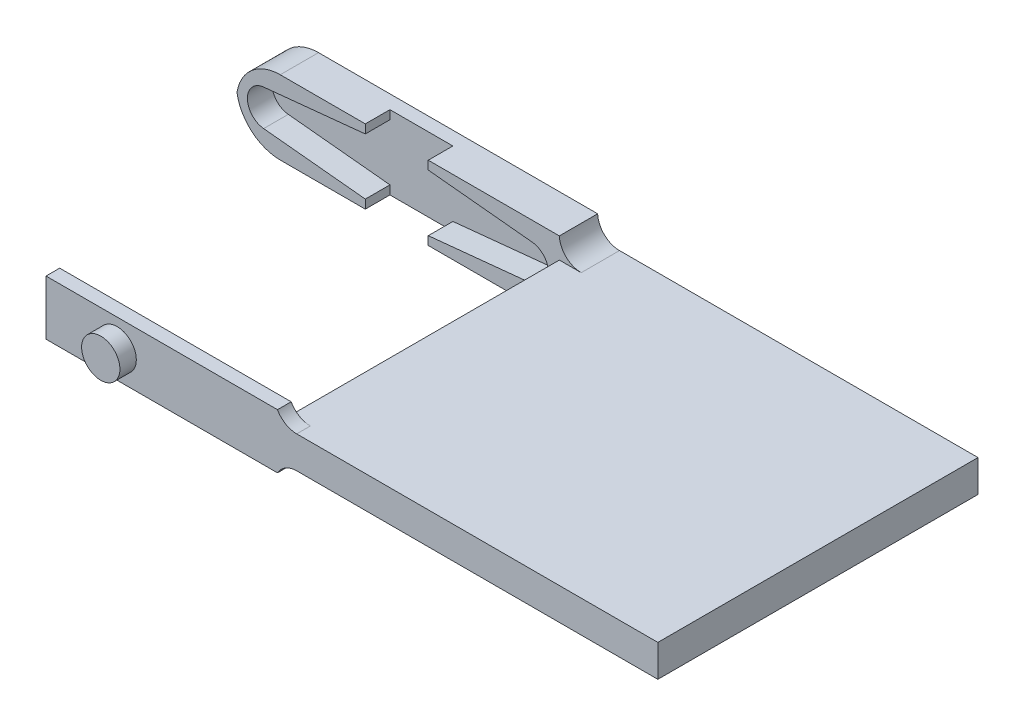
ISO-10303-21;
HEADER;
FILE_DESCRIPTION(('STEP AP214'),'2;1');
FILE_NAME('part.step','',(''),(''),'','','');
FILE_SCHEMA(('AUTOMOTIVE_DESIGN { 1 0 10303 214 1 1 1 1 }'));
ENDSEC;
DATA;
#1=APPLICATION_CONTEXT('core data for automotive mechanical design processes');
#2=APPLICATION_PROTOCOL_DEFINITION('international standard','automotive_design',2000,#1);
#3=PRODUCT_CONTEXT('',#1,'mechanical');
#4=PRODUCT('Part','Part','',(#3));
#5=PRODUCT_RELATED_PRODUCT_CATEGORY('part','',(#4));
#6=PRODUCT_DEFINITION_FORMATION('','',#4);
#7=PRODUCT_DEFINITION_CONTEXT('part definition',#1,'design');
#8=PRODUCT_DEFINITION('design','',#6,#7);
#9=PRODUCT_DEFINITION_SHAPE('','',#8);
#10=(LENGTH_UNIT() NAMED_UNIT(*) SI_UNIT(.MILLI.,.METRE.));
#11=(NAMED_UNIT(*) PLANE_ANGLE_UNIT() SI_UNIT($,.RADIAN.));
#12=(NAMED_UNIT(*) SI_UNIT($,.STERADIAN.) SOLID_ANGLE_UNIT());
#13=UNCERTAINTY_MEASURE_WITH_UNIT(LENGTH_MEASURE(1.E-05),#10,'distance_accuracy_value','');
#14=(GEOMETRIC_REPRESENTATION_CONTEXT(3) GLOBAL_UNCERTAINTY_ASSIGNED_CONTEXT((#13)) GLOBAL_UNIT_ASSIGNED_CONTEXT((#10,
#11,#12)) REPRESENTATION_CONTEXT('',''));
#15=CARTESIAN_POINT('',(0.,0.,0.));
#16=DIRECTION('',(0.,0.,1.));
#17=DIRECTION('',(1.,0.,0.));
#18=AXIS2_PLACEMENT_3D('',#15,#16,#17);
#19=CARTESIAN_POINT('',(0.,0.,29.2499999999999));
#20=DIRECTION('',(0.,0.,1.));
#21=DIRECTION('',(1.,0.,0.));
#22=AXIS2_PLACEMENT_3D('',#19,#20,#21);
#23=PLANE('',#22);
#24=DIRECTION('',(1.,0.,0.));
#25=VECTOR('',#24,1.);
#26=CARTESIAN_POINT('',(0.,4.83707186120483,29.2499999999999));
#27=LINE('',#26,#25);
#28=CARTESIAN_POINT('',(16.5034017605437,4.83707186120483,29.2499999999999));
#29=VERTEX_POINT('',#28);
#30=CARTESIAN_POINT('',(49.5,4.83707186120483,29.2499999999999));
#31=VERTEX_POINT('',#30);
#32=EDGE_CURVE('E509',#29,#31,#27,.T.);
#33=ORIENTED_EDGE('',*,*,#32,.F.);
#34=CARTESIAN_POINT('',(16.5034017605437,6.83707186120483,29.2499999999999));
#35=DIRECTION('',(0.,0.,1.));
#36=DIRECTION('',(1.,0.,0.));
#37=AXIS2_PLACEMENT_3D('',#34,#35,#36);
#38=CIRCLE('',#37,2.);
#39=CARTESIAN_POINT('',(14.75,5.87500000000001,29.2499999999999));
#40=VERTEX_POINT('',#39);
#41=EDGE_CURVE('E445',#29,#40,#38,.F.);
#42=ORIENTED_EDGE('',*,*,#41,.T.);
#43=DIRECTION('',(1.,0.,0.));
#44=VECTOR('',#43,1.);
#45=CARTESIAN_POINT('',(0.,5.87500000000001,29.2499999999999));
#46=LINE('',#45,#44);
#47=CARTESIAN_POINT('',(-6.4,5.875,29.2499999999999));
#48=VERTEX_POINT('',#47);
#49=EDGE_CURVE('E470',#48,#40,#46,.T.);
#50=ORIENTED_EDGE('',*,*,#49,.F.);
#51=DIRECTION('',(0.,-1.,0.));
#52=VECTOR('',#51,1.);
#53=CARTESIAN_POINT('',(-6.4,0.,29.2499999999999));
#54=LINE('',#53,#52);
#55=CARTESIAN_POINT('',(-6.4,0.875000000000003,29.2499999999999));
#56=VERTEX_POINT('',#55);
#57=EDGE_CURVE('E473',#48,#56,#54,.T.);
#58=ORIENTED_EDGE('',*,*,#57,.T.);
#59=DIRECTION('',(1.,0.,0.));
#60=VECTOR('',#59,1.);
#61=CARTESIAN_POINT('',(0.,0.875000000000003,29.2499999999999));
#62=LINE('',#61,#60);
#63=CARTESIAN_POINT('',(14.75,0.875000000000003,29.2499999999999));
#64=VERTEX_POINT('',#63);
#65=EDGE_CURVE('E488',#56,#64,#62,.T.);
#66=ORIENTED_EDGE('',*,*,#65,.T.);
#67=CARTESIAN_POINT('',(16.5034017605437,-0.0870718612048299,29.2499999999999));
#68=DIRECTION('',(0.,0.,1.));
#69=DIRECTION('',(1.,0.,0.));
#70=AXIS2_PLACEMENT_3D('',#67,#68,#69);
#71=CIRCLE('',#70,2.);
#72=CARTESIAN_POINT('',(16.5034017605437,1.91292813879517,29.2499999999999));
#73=VERTEX_POINT('',#72);
#74=EDGE_CURVE('E449',#64,#73,#71,.F.);
#75=ORIENTED_EDGE('',*,*,#74,.T.);
#76=DIRECTION('',(1.,0.,0.));
#77=VECTOR('',#76,1.);
#78=CARTESIAN_POINT('',(0.,1.91292813879517,29.2499999999999));
#79=LINE('',#78,#77);
#80=CARTESIAN_POINT('',(49.5,1.91292813879517,29.2499999999999));
#81=VERTEX_POINT('',#80);
#82=EDGE_CURVE('E511',#73,#81,#79,.T.);
#83=ORIENTED_EDGE('',*,*,#82,.T.);
#84=DIRECTION('',(0.,-1.,0.));
#85=VECTOR('',#84,1.);
#86=CARTESIAN_POINT('',(49.5,0.,29.2499999999999));
#87=LINE('',#86,#85);
#88=EDGE_CURVE('E513',#31,#81,#87,.T.);
#89=ORIENTED_EDGE('',*,*,#88,.F.);
#90=EDGE_LOOP('',(#33,#42,#50,#58,#66,#75,#83,#89));
#91=FACE_BOUND('',#90,.T.);
#92=CARTESIAN_POINT('',(0.102107464172101,3.37499999999936,29.2499999999999));
#93=DIRECTION('',(0.,0.,1.));
#94=DIRECTION('',(1.,0.,0.));
#95=AXIS2_PLACEMENT_3D('',#92,#93,#94);
#96=CIRCLE('',#95,1.75000000000144);
#97=CARTESIAN_POINT('',(1.85210746417354,3.37499999999936,29.2499999999999));
#98=VERTEX_POINT('',#97);
#99=EDGE_CURVE('E592',#98,#98,#96,.T.);
#100=ORIENTED_EDGE('',*,*,#99,.F.);
#101=EDGE_LOOP('',(#100));
#102=FACE_BOUND('',#101,.T.);
#103=ADVANCED_FACE('F139',(#91,#102),#23,.T.);
#104=CARTESIAN_POINT('',(0.,0.,3.5));
#105=DIRECTION('',(0.,0.,1.));
#106=DIRECTION('',(1.,0.,0.));
#107=AXIS2_PLACEMENT_3D('',#104,#105,#106);
#108=PLANE('',#107);
#109=DIRECTION('',(0.,-1.,0.));
#110=VECTOR('',#109,1.);
#111=CARTESIAN_POINT('',(-2.97710746417078,0.,3.5));
#112=LINE('',#111,#110);
#113=CARTESIAN_POINT('',(-2.97710746417078,0.799354218209792,3.5));
#114=VERTEX_POINT('',#113);
#115=CARTESIAN_POINT('',(-2.97710746417078,0.,3.5));
#116=VERTEX_POINT('',#115);
#117=EDGE_CURVE('E330',#114,#116,#112,.T.);
#118=ORIENTED_EDGE('',*,*,#117,.F.);
#119=DIRECTION('',(0.994982658758142,-0.10004753255617,0.));
#120=VECTOR('',#119,1.);
#121=CARTESIAN_POINT('',(0.0497727799724651,0.494995245614711,3.5));
#122=LINE('',#121,#120);
#123=CARTESIAN_POINT('',(-12.2650784287177,1.73327861304907,3.5));
#124=VERTEX_POINT('',#123);
#125=EDGE_CURVE('E370',#124,#114,#122,.T.);
#126=ORIENTED_EDGE('',*,*,#125,.F.);
#127=CARTESIAN_POINT('',(-12.1,3.375,3.5));
#128=DIRECTION('',(0.,0.,1.));
#129=DIRECTION('',(1.,0.,0.));
#130=AXIS2_PLACEMENT_3D('',#127,#128,#129);
#131=CIRCLE('',#130,1.65);
#132=CARTESIAN_POINT('',(-12.2650784287177,5.01672138695093,3.5));
#133=VERTEX_POINT('',#132);
#134=EDGE_CURVE('E372',#133,#124,#131,.T.);
#135=ORIENTED_EDGE('',*,*,#134,.F.);
#136=DIRECTION('',(0.994982658758143,0.100047532556171,0.));
#137=VECTOR('',#136,1.);
#138=CARTESIAN_POINT('',(-0.622159749655816,6.18744057018389,3.5));
#139=LINE('',#138,#137);
#140=CARTESIAN_POINT('',(-2.97710746417078,5.95064578179021,3.5));
#141=VERTEX_POINT('',#140);
#142=EDGE_CURVE('E375',#133,#141,#139,.T.);
#143=ORIENTED_EDGE('',*,*,#142,.T.);
#144=DIRECTION('',(0.,-1.,0.));
#145=VECTOR('',#144,1.);
#146=CARTESIAN_POINT('',(-2.97710746417078,6.74999999999995,3.5));
#147=LINE('',#146,#145);
#148=CARTESIAN_POINT('',(-2.97710746417078,6.74999999999995,3.5));
#149=VERTEX_POINT('',#148);
#150=EDGE_CURVE('E605',#149,#141,#147,.T.);
#151=ORIENTED_EDGE('',*,*,#150,.F.);
#152=DIRECTION('',(1.,0.,0.));
#153=VECTOR('',#152,1.);
#154=CARTESIAN_POINT('',(0.,6.75,3.5));
#155=LINE('',#154,#153);
#156=CARTESIAN_POINT('',(-10.75,6.75,3.5));
#157=VERTEX_POINT('',#156);
#158=EDGE_CURVE('E361',#157,#149,#155,.T.);
#159=ORIENTED_EDGE('',*,*,#158,.F.);
#160=CARTESIAN_POINT('',(-10.75,2.75,3.5));
#161=DIRECTION('',(0.,0.,1.));
#162=DIRECTION('',(1.,0.,0.));
#163=AXIS2_PLACEMENT_3D('',#160,#161,#162);
#164=CIRCLE('',#163,4.);
#165=CARTESIAN_POINT('',(-14.7008701573198,3.37499999999999,3.5));
#166=VERTEX_POINT('',#165);
#167=EDGE_CURVE('E148',#157,#166,#164,.T.);
#168=ORIENTED_EDGE('',*,*,#167,.T.);
#169=CARTESIAN_POINT('',(-10.75,4.,3.5));
#170=DIRECTION('',(0.,0.,1.));
#171=DIRECTION('',(1.,0.,0.));
#172=AXIS2_PLACEMENT_3D('',#169,#170,#171);
#173=CIRCLE('',#172,4.);
#174=CARTESIAN_POINT('',(-10.75,0.,3.5));
#175=VERTEX_POINT('',#174);
#176=EDGE_CURVE('E354',#166,#175,#173,.T.);
#177=ORIENTED_EDGE('',*,*,#176,.T.);
#178=DIRECTION('',(1.,0.,0.));
#179=VECTOR('',#178,1.);
#180=CARTESIAN_POINT('',(0.,0.,3.5));
#181=LINE('',#180,#179);
#182=EDGE_CURVE('E347',#175,#116,#181,.T.);
#183=ORIENTED_EDGE('',*,*,#182,.T.);
#184=EDGE_LOOP('',(#118,#126,#135,#143,#151,#159,#168,#177,#183));
#185=FACE_BOUND('',#184,.T.);
#186=ADVANCED_FACE('F352',(#185),#108,.T.);
#187=CARTESIAN_POINT('',(14.75,0.,29.2499999999999));
#188=DIRECTION('',(1.,0.,0.));
#189=DIRECTION('',(0.,1.,0.));
#190=AXIS2_PLACEMENT_3D('',#187,#188,#189);
#191=PLANE('',#190);
#192=DIRECTION('',(0.,-1.,0.));
#193=VECTOR('',#192,1.);
#194=CARTESIAN_POINT('',(14.75,0.,27.9999999999999));
#195=LINE('',#194,#193);
#196=CARTESIAN_POINT('',(14.75,4.83707186120483,27.9999999999999));
#197=VERTEX_POINT('',#196);
#198=CARTESIAN_POINT('',(14.75,1.91292813879517,27.9999999999999));
#199=VERTEX_POINT('',#198);
#200=EDGE_CURVE('E484',#197,#199,#195,.T.);
#201=ORIENTED_EDGE('',*,*,#200,.F.);
#202=DIRECTION('',(0.,0.,-1.));
#203=VECTOR('',#202,1.);
#204=CARTESIAN_POINT('',(14.75,4.83707186120483,29.2499999999999));
#205=LINE('',#204,#203);
#206=CARTESIAN_POINT('',(14.75,4.83707186120483,3.5));
#207=VERTEX_POINT('',#206);
#208=EDGE_CURVE('E527',#197,#207,#205,.T.);
#209=ORIENTED_EDGE('',*,*,#208,.T.);
#210=DIRECTION('',(0.,-1.,0.));
#211=VECTOR('',#210,1.);
#212=CARTESIAN_POINT('',(14.75,0.,3.5));
#213=LINE('',#212,#211);
#214=CARTESIAN_POINT('',(14.75,1.91292813879517,3.5));
#215=VERTEX_POINT('',#214);
#216=EDGE_CURVE('E384',#207,#215,#213,.T.);
#217=ORIENTED_EDGE('',*,*,#216,.T.);
#218=DIRECTION('',(0.,0.,-1.));
#219=VECTOR('',#218,1.);
#220=CARTESIAN_POINT('',(14.75,1.91292813879517,29.2499999999999));
#221=LINE('',#220,#219);
#222=EDGE_CURVE('E524',#199,#215,#221,.T.);
#223=ORIENTED_EDGE('',*,*,#222,.F.);
#224=EDGE_LOOP('',(#201,#209,#217,#223));
#225=FACE_BOUND('',#224,.T.);
#226=ADVANCED_FACE('F647',(#225),#191,.F.);
#227=CARTESIAN_POINT('',(0.622159749655816,6.18744057018389,3.5));
#228=DIRECTION('',(-0.100047532556171,-0.994982658758142,0.));
#229=DIRECTION('',(0.994982658758142,-0.100047532556171,0.));
#230=AXIS2_PLACEMENT_3D('',#227,#228,#229);
#231=PLANE('',#230);
#232=DIRECTION('',(0.,0.,1.));
#233=VECTOR('',#232,1.);
#234=CARTESIAN_POINT('',(2.77289253582379,5.97118000870603,3.5));
#235=LINE('',#234,#233);
#236=CARTESIAN_POINT('',(2.77289253582379,5.97118000870603,1.24999999999901));
#237=VERTEX_POINT('',#236);
#238=CARTESIAN_POINT('',(2.77289253582379,5.97118000870603,3.5));
#239=VERTEX_POINT('',#238);
#240=EDGE_CURVE('E163',#237,#239,#235,.T.);
#241=ORIENTED_EDGE('',*,*,#240,.F.);
#242=DIRECTION('',(-0.994982658758143,0.100047532556171,0.));
#243=VECTOR('',#242,1.);
#244=CARTESIAN_POINT('',(0.622159749655816,6.18744057018389,1.25));
#245=LINE('',#244,#243);
#246=CARTESIAN_POINT('',(12.2650784287177,5.01672138695093,1.25));
#247=VERTEX_POINT('',#246);
#248=EDGE_CURVE('E533',#247,#237,#245,.T.);
#249=ORIENTED_EDGE('',*,*,#248,.F.);
#250=DIRECTION('',(0.,0.,-1.));
#251=VECTOR('',#250,1.);
#252=CARTESIAN_POINT('',(12.2650784287177,5.01672138695093,3.5));
#253=LINE('',#252,#251);
#254=CARTESIAN_POINT('',(12.2650784287177,5.01672138695093,3.5));
#255=VERTEX_POINT('',#254);
#256=EDGE_CURVE('E395',#255,#247,#253,.T.);
#257=ORIENTED_EDGE('',*,*,#256,.F.);
#258=DIRECTION('',(-0.994982658758143,0.100047532556171,0.));
#259=VECTOR('',#258,1.);
#260=CARTESIAN_POINT('',(0.622159749655816,6.18744057018389,3.5));
#261=LINE('',#260,#259);
#262=EDGE_CURVE('E355',#255,#239,#261,.T.);
#263=ORIENTED_EDGE('',*,*,#262,.T.);
#264=EDGE_LOOP('',(#241,#249,#257,#263));
#265=FACE_BOUND('',#264,.T.);
#266=ADVANCED_FACE('F662',(#265),#231,.T.);
#267=CARTESIAN_POINT('',(12.1,3.375,3.5));
#268=DIRECTION('',(0.,0.,-1.));
#269=DIRECTION('',(-1.,0.,0.));
#270=AXIS2_PLACEMENT_3D('',#267,#268,#269);
#271=CYLINDRICAL_SURFACE('',#270,1.64999999999999);
#272=ORIENTED_EDGE('',*,*,#256,.T.);
#273=CARTESIAN_POINT('',(12.1,3.375,1.25));
#274=DIRECTION('',(0.,0.,1.));
#275=DIRECTION('',(1.,0.,0.));
#276=AXIS2_PLACEMENT_3D('',#273,#274,#275);
#277=CIRCLE('',#276,1.64999999999999);
#278=CARTESIAN_POINT('',(12.2650784287177,1.73327861304907,1.25));
#279=VERTEX_POINT('',#278);
#280=EDGE_CURVE('E530',#247,#279,#277,.F.);
#281=ORIENTED_EDGE('',*,*,#280,.T.);
#282=DIRECTION('',(0.,0.,-1.));
#283=VECTOR('',#282,1.);
#284=CARTESIAN_POINT('',(12.2650784287177,1.73327861304907,3.5));
#285=LINE('',#284,#283);
#286=CARTESIAN_POINT('',(12.2650784287177,1.73327861304907,3.5));
#287=VERTEX_POINT('',#286);
#288=EDGE_CURVE('E392',#287,#279,#285,.T.);
#289=ORIENTED_EDGE('',*,*,#288,.F.);
#290=CARTESIAN_POINT('',(12.1,3.375,3.5));
#291=DIRECTION('',(0.,0.,1.));
#292=DIRECTION('',(1.,0.,0.));
#293=AXIS2_PLACEMENT_3D('',#290,#291,#292);
#294=CIRCLE('',#293,1.64999999999999);
#295=EDGE_CURVE('E359',#255,#287,#294,.F.);
#296=ORIENTED_EDGE('',*,*,#295,.F.);
#297=EDGE_LOOP('',(#272,#281,#289,#296));
#298=FACE_BOUND('',#297,.T.);
#299=ADVANCED_FACE('F638',(#298),#271,.F.);
#300=CARTESIAN_POINT('',(-0.0497727799724653,0.49499524561471,3.5));
#301=DIRECTION('',(0.100047532556171,-0.994982658758142,0.));
#302=DIRECTION('',(0.994982658758143,0.100047532556171,0.));
#303=AXIS2_PLACEMENT_3D('',#300,#301,#302);
#304=PLANE('',#303);
#305=DIRECTION('',(-0.994982658758142,-0.100047532556171,0.));
#306=VECTOR('',#305,1.);
#307=CARTESIAN_POINT('',(-0.0497727799724653,0.49499524561471,1.25));
#308=LINE('',#307,#306);
#309=CARTESIAN_POINT('',(2.77289253582379,0.778819991293967,1.24999999999901));
#310=VERTEX_POINT('',#309);
#311=EDGE_CURVE('E382',#279,#310,#308,.T.);
#312=ORIENTED_EDGE('',*,*,#311,.T.);
#313=DIRECTION('',(0.,0.,1.));
#314=VECTOR('',#313,1.);
#315=CARTESIAN_POINT('',(2.77289253582379,0.778819991293967,3.5));
#316=LINE('',#315,#314);
#317=CARTESIAN_POINT('',(2.77289253582379,0.778819991293967,3.5));
#318=VERTEX_POINT('',#317);
#319=EDGE_CURVE('E599',#310,#318,#316,.T.);
#320=ORIENTED_EDGE('',*,*,#319,.T.);
#321=DIRECTION('',(-0.994982658758142,-0.100047532556171,0.));
#322=VECTOR('',#321,1.);
#323=CARTESIAN_POINT('',(-0.0497727799724653,0.49499524561471,3.5));
#324=LINE('',#323,#322);
#325=EDGE_CURVE('E367',#287,#318,#324,.T.);
#326=ORIENTED_EDGE('',*,*,#325,.F.);
#327=ORIENTED_EDGE('',*,*,#288,.T.);
#328=EDGE_LOOP('',(#312,#320,#326,#327));
#329=FACE_BOUND('',#328,.T.);
#330=ADVANCED_FACE('F631',(#329),#304,.F.);
#331=CARTESIAN_POINT('',(0.0497727799724651,0.494995245614711,3.5));
#332=DIRECTION('',(0.10004753255617,0.994982658758143,0.));
#333=DIRECTION('',(-0.994982658758143,0.10004753255617,0.));
#334=AXIS2_PLACEMENT_3D('',#331,#332,#333);
#335=PLANE('',#334);
#336=DIRECTION('',(0.,0.,1.));
#337=VECTOR('',#336,1.);
#338=CARTESIAN_POINT('',(-2.97710746417078,0.799354218209792,3.5));
#339=LINE('',#338,#337);
#340=CARTESIAN_POINT('',(-2.97710746417078,0.799354218209792,1.24999999999901));
#341=VERTEX_POINT('',#340);
#342=EDGE_CURVE('E336',#341,#114,#339,.T.);
#343=ORIENTED_EDGE('',*,*,#342,.F.);
#344=DIRECTION('',(0.994982658758142,-0.10004753255617,0.));
#345=VECTOR('',#344,1.);
#346=CARTESIAN_POINT('',(0.0497727799724651,0.494995245614711,1.25));
#347=LINE('',#346,#345);
#348=CARTESIAN_POINT('',(-12.2650784287177,1.73327861304907,1.25));
#349=VERTEX_POINT('',#348);
#350=EDGE_CURVE('E540',#349,#341,#347,.T.);
#351=ORIENTED_EDGE('',*,*,#350,.F.);
#352=DIRECTION('',(0.,0.,-1.));
#353=VECTOR('',#352,1.);
#354=CARTESIAN_POINT('',(-12.2650784287177,1.73327861304907,3.5));
#355=LINE('',#354,#353);
#356=EDGE_CURVE('E388',#124,#349,#355,.T.);
#357=ORIENTED_EDGE('',*,*,#356,.F.);
#358=ORIENTED_EDGE('',*,*,#125,.T.);
#359=EDGE_LOOP('',(#343,#351,#357,#358));
#360=FACE_BOUND('',#359,.T.);
#361=ADVANCED_FACE('F629',(#360),#335,.T.);
#362=CARTESIAN_POINT('',(-12.1,3.375,3.5));
#363=DIRECTION('',(0.,0.,-1.));
#364=DIRECTION('',(-1.,0.,0.));
#365=AXIS2_PLACEMENT_3D('',#362,#363,#364);
#366=CYLINDRICAL_SURFACE('',#365,1.65);
#367=CARTESIAN_POINT('',(-12.1,3.375,1.25));
#368=DIRECTION('',(0.,0.,1.));
#369=DIRECTION('',(1.,0.,0.));
#370=AXIS2_PLACEMENT_3D('',#367,#368,#369);
#371=CIRCLE('',#370,1.65);
#372=CARTESIAN_POINT('',(-12.2650784287177,5.01672138695093,1.25));
#373=VERTEX_POINT('',#372);
#374=EDGE_CURVE('E538',#373,#349,#371,.T.);
#375=ORIENTED_EDGE('',*,*,#374,.F.);
#376=DIRECTION('',(0.,0.,-1.));
#377=VECTOR('',#376,1.);
#378=CARTESIAN_POINT('',(-12.2650784287177,5.01672138695093,3.5));
#379=LINE('',#378,#377);
#380=EDGE_CURVE('E385',#133,#373,#379,.T.);
#381=ORIENTED_EDGE('',*,*,#380,.F.);
#382=ORIENTED_EDGE('',*,*,#134,.T.);
#383=ORIENTED_EDGE('',*,*,#356,.T.);
#384=EDGE_LOOP('',(#375,#381,#382,#383));
#385=FACE_BOUND('',#384,.T.);
#386=ADVANCED_FACE('F624',(#385),#366,.F.);
#387=CARTESIAN_POINT('',(0.,6.75,3.5));
#388=DIRECTION('',(0.,1.,0.));
#389=DIRECTION('',(0.,0.,1.));
#390=AXIS2_PLACEMENT_3D('',#387,#388,#389);
#391=PLANE('',#390);
#392=DIRECTION('',(0.,0.,1.));
#393=VECTOR('',#392,1.);
#394=CARTESIAN_POINT('',(-2.97710746417078,6.74999999999995,-4.60902082262464));
#395=LINE('',#394,#393);
#396=CARTESIAN_POINT('',(-2.97710746417078,6.74999999999995,1.24999999999901));
#397=VERTEX_POINT('',#396);
#398=EDGE_CURVE('E480',#397,#149,#395,.T.);
#399=ORIENTED_EDGE('',*,*,#398,.F.);
#400=DIRECTION('',(-1.,0.,0.));
#401=VECTOR('',#400,1.);
#402=CARTESIAN_POINT('',(-2.97710746417078,6.74999999999995,1.24999999999901));
#403=LINE('',#402,#401);
#404=CARTESIAN_POINT('',(2.77289253582378,6.74999999999995,1.24999999999901));
#405=VERTEX_POINT('',#404);
#406=EDGE_CURVE('E613',#405,#397,#403,.T.);
#407=ORIENTED_EDGE('',*,*,#406,.F.);
#408=DIRECTION('',(0.,0.,1.));
#409=VECTOR('',#408,1.);
#410=CARTESIAN_POINT('',(2.77289253582378,6.74999999999995,-4.60902082262464));
#411=LINE('',#410,#409);
#412=CARTESIAN_POINT('',(2.77289253582378,6.74999999999995,3.5));
#413=VERTEX_POINT('',#412);
#414=EDGE_CURVE('E616',#405,#413,#411,.T.);
#415=ORIENTED_EDGE('',*,*,#414,.T.);
#416=CARTESIAN_POINT('',(14.75,6.75,3.5));
#417=VERTEX_POINT('',#416);
#418=EDGE_CURVE('E545',#413,#417,#155,.T.);
#419=ORIENTED_EDGE('',*,*,#418,.T.);
#420=DIRECTION('',(0.,0.,-1.));
#421=VECTOR('',#420,1.);
#422=CARTESIAN_POINT('',(14.75,6.75,3.5));
#423=LINE('',#422,#421);
#424=CARTESIAN_POINT('',(14.75,6.75,0.));
#425=VERTEX_POINT('',#424);
#426=EDGE_CURVE('E389',#417,#425,#423,.T.);
#427=ORIENTED_EDGE('',*,*,#426,.T.);
#428=DIRECTION('',(1.,0.,0.));
#429=VECTOR('',#428,1.);
#430=CARTESIAN_POINT('',(0.,6.75,0.));
#431=LINE('',#430,#429);
#432=CARTESIAN_POINT('',(-10.75,6.75,0.));
#433=VERTEX_POINT('',#432);
#434=EDGE_CURVE('E379',#433,#425,#431,.T.);
#435=ORIENTED_EDGE('',*,*,#434,.F.);
#436=DIRECTION('',(0.,0.,-1.));
#437=VECTOR('',#436,1.);
#438=CARTESIAN_POINT('',(-10.75,6.75,3.5));
#439=LINE('',#438,#437);
#440=EDGE_CURVE('E455',#433,#157,#439,.F.);
#441=ORIENTED_EDGE('',*,*,#440,.T.);
#442=ORIENTED_EDGE('',*,*,#158,.T.);
#443=EDGE_LOOP('',(#399,#407,#415,#419,#427,#435,#441,#442));
#444=FACE_BOUND('',#443,.T.);
#445=ADVANCED_FACE('F553',(#444),#391,.T.);
#446=CARTESIAN_POINT('',(0.,0.,3.5));
#447=DIRECTION('',(0.,1.,0.));
#448=DIRECTION('',(0.,0.,1.));
#449=AXIS2_PLACEMENT_3D('',#446,#447,#448);
#450=PLANE('',#449);
#451=DIRECTION('',(1.,0.,0.));
#452=VECTOR('',#451,1.);
#453=CARTESIAN_POINT('',(-2.97710746417078,0.,1.24999999999901));
#454=LINE('',#453,#452);
#455=CARTESIAN_POINT('',(-2.97710746417078,0.,1.24999999999901));
#456=VERTEX_POINT('',#455);
#457=CARTESIAN_POINT('',(2.77289253582379,0.,1.24999999999901));
#458=VERTEX_POINT('',#457);
#459=EDGE_CURVE('E350',#456,#458,#454,.T.);
#460=ORIENTED_EDGE('',*,*,#459,.F.);
#461=DIRECTION('',(0.,0.,1.));
#462=VECTOR('',#461,1.);
#463=CARTESIAN_POINT('',(-2.97710746417078,0.,-4.60902082262464));
#464=LINE('',#463,#462);
#465=EDGE_CURVE('E333',#456,#116,#464,.T.);
#466=ORIENTED_EDGE('',*,*,#465,.T.);
#467=ORIENTED_EDGE('',*,*,#182,.F.);
#468=DIRECTION('',(0.,0.,-1.));
#469=VECTOR('',#468,1.);
#470=CARTESIAN_POINT('',(-10.75,0.,0.));
#471=LINE('',#470,#469);
#472=CARTESIAN_POINT('',(-10.75,0.,0.));
#473=VERTEX_POINT('',#472);
#474=EDGE_CURVE('E12',#175,#473,#471,.T.);
#475=ORIENTED_EDGE('',*,*,#474,.T.);
#476=DIRECTION('',(1.,0.,0.));
#477=VECTOR('',#476,1.);
#478=CARTESIAN_POINT('',(0.,0.,0.));
#479=LINE('',#478,#477);
#480=CARTESIAN_POINT('',(14.75,0.,0.));
#481=VERTEX_POINT('',#480);
#482=EDGE_CURVE('E381',#473,#481,#479,.T.);
#483=ORIENTED_EDGE('',*,*,#482,.T.);
#484=DIRECTION('',(0.,0.,-1.));
#485=VECTOR('',#484,1.);
#486=CARTESIAN_POINT('',(14.75,0.,3.5));
#487=LINE('',#486,#485);
#488=CARTESIAN_POINT('',(14.75,0.,3.5));
#489=VERTEX_POINT('',#488);
#490=EDGE_CURVE('E378',#489,#481,#487,.T.);
#491=ORIENTED_EDGE('',*,*,#490,.F.);
#492=CARTESIAN_POINT('',(2.77289253582379,0.,3.5));
#493=VERTEX_POINT('',#492);
#494=EDGE_CURVE('E356',#493,#489,#181,.T.);
#495=ORIENTED_EDGE('',*,*,#494,.F.);
#496=DIRECTION('',(0.,0.,1.));
#497=VECTOR('',#496,1.);
#498=CARTESIAN_POINT('',(2.77289253582379,0.,-4.60902082262464));
#499=LINE('',#498,#497);
#500=EDGE_CURVE('E155',#458,#493,#499,.T.);
#501=ORIENTED_EDGE('',*,*,#500,.F.);
#502=EDGE_LOOP('',(#460,#466,#467,#475,#483,#491,#495,#501));
#503=FACE_BOUND('',#502,.T.);
#504=ADVANCED_FACE('F346',(#503),#450,.F.);
#505=CARTESIAN_POINT('',(-0.622159749655816,6.18744057018389,3.5));
#506=DIRECTION('',(-0.100047532556171,0.994982658758142,0.));
#507=DIRECTION('',(-0.994982658758142,-0.100047532556171,0.));
#508=AXIS2_PLACEMENT_3D('',#505,#506,#507);
#509=PLANE('',#508);
#510=DIRECTION('',(0.994982658758143,0.100047532556171,0.));
#511=VECTOR('',#510,1.);
#512=CARTESIAN_POINT('',(-0.622159749655816,6.18744057018389,1.25));
#513=LINE('',#512,#511);
#514=CARTESIAN_POINT('',(-2.97710746417078,5.95064578179021,1.24999999999901));
#515=VERTEX_POINT('',#514);
#516=EDGE_CURVE('E536',#373,#515,#513,.T.);
#517=ORIENTED_EDGE('',*,*,#516,.T.);
#518=DIRECTION('',(0.,0.,1.));
#519=VECTOR('',#518,1.);
#520=CARTESIAN_POINT('',(-2.97710746417078,5.95064578179021,3.5));
#521=LINE('',#520,#519);
#522=EDGE_CURVE('E471',#515,#141,#521,.T.);
#523=ORIENTED_EDGE('',*,*,#522,.T.);
#524=ORIENTED_EDGE('',*,*,#142,.F.);
#525=ORIENTED_EDGE('',*,*,#380,.T.);
#526=EDGE_LOOP('',(#517,#523,#524,#525));
#527=FACE_BOUND('',#526,.T.);
#528=ADVANCED_FACE('F621',(#527),#509,.F.);
#529=DIRECTION('',(0.,1.,0.));
#530=VECTOR('',#529,1.);
#531=CARTESIAN_POINT('',(2.77289253582379,0.,3.5));
#532=LINE('',#531,#530);
#533=EDGE_CURVE('E342',#493,#318,#532,.T.);
#534=ORIENTED_EDGE('',*,*,#533,.F.);
#535=ORIENTED_EDGE('',*,*,#494,.T.);
#536=CARTESIAN_POINT('',(16.7481037237807,-0.0870718612048299,3.5));
#537=DIRECTION('',(0.,0.,1.));
#538=DIRECTION('',(1.,0.,0.));
#539=AXIS2_PLACEMENT_3D('',#536,#537,#538);
#540=CIRCLE('',#539,2.);
#541=CARTESIAN_POINT('',(16.7481037237807,1.91292813879517,3.5));
#542=VERTEX_POINT('',#541);
#543=EDGE_CURVE('E441',#489,#542,#540,.F.);
#544=ORIENTED_EDGE('',*,*,#543,.T.);
#545=DIRECTION('',(1.,0.,0.));
#546=VECTOR('',#545,1.);
#547=CARTESIAN_POINT('',(0.,1.91292813879517,3.5));
#548=LINE('',#547,#546);
#549=EDGE_CURVE('E427',#215,#542,#548,.T.);
#550=ORIENTED_EDGE('',*,*,#549,.F.);
#551=ORIENTED_EDGE('',*,*,#216,.F.);
#552=DIRECTION('',(-1.,0.,0.));
#553=VECTOR('',#552,1.);
#554=CARTESIAN_POINT('',(0.,4.83707186120483,3.5));
#555=LINE('',#554,#553);
#556=CARTESIAN_POINT('',(16.7481037237807,4.83707186120483,3.5));
#557=VERTEX_POINT('',#556);
#558=EDGE_CURVE('E415',#557,#207,#555,.T.);
#559=ORIENTED_EDGE('',*,*,#558,.F.);
#560=CARTESIAN_POINT('',(16.7481037237807,6.83707186120483,3.5));
#561=DIRECTION('',(0.,0.,1.));
#562=DIRECTION('',(1.,0.,0.));
#563=AXIS2_PLACEMENT_3D('',#560,#561,#562);
#564=CIRCLE('',#563,2.);
#565=EDGE_CURVE('E435',#557,#417,#564,.F.);
#566=ORIENTED_EDGE('',*,*,#565,.T.);
#567=ORIENTED_EDGE('',*,*,#418,.F.);
#568=DIRECTION('',(0.,1.,0.));
#569=VECTOR('',#568,1.);
#570=CARTESIAN_POINT('',(2.77289253582378,6.74999999999995,3.5));
#571=LINE('',#570,#569);
#572=EDGE_CURVE('E606',#239,#413,#571,.T.);
#573=ORIENTED_EDGE('',*,*,#572,.F.);
#574=ORIENTED_EDGE('',*,*,#262,.F.);
#575=ORIENTED_EDGE('',*,*,#295,.T.);
#576=ORIENTED_EDGE('',*,*,#325,.T.);
#577=EDGE_LOOP('',(#534,#535,#544,#550,#551,#559,#566,#567,#573,#574,#575,#576));
#578=FACE_BOUND('',#577,.T.);
#579=ADVANCED_FACE('F587',(#578),#108,.T.);
#580=CARTESIAN_POINT('',(0.,0.,0.));
#581=DIRECTION('',(0.,0.,1.));
#582=DIRECTION('',(1.,0.,0.));
#583=AXIS2_PLACEMENT_3D('',#580,#581,#582);
#584=PLANE('',#583);
#585=CARTESIAN_POINT('',(-10.75,4.,0.));
#586=DIRECTION('',(0.,0.,1.));
#587=DIRECTION('',(1.,0.,0.));
#588=AXIS2_PLACEMENT_3D('',#585,#586,#587);
#589=CIRCLE('',#588,4.);
#590=CARTESIAN_POINT('',(-14.7008701573198,3.37499999999999,0.));
#591=VERTEX_POINT('',#590);
#592=EDGE_CURVE('E451',#473,#591,#589,.F.);
#593=ORIENTED_EDGE('',*,*,#592,.T.);
#594=CARTESIAN_POINT('',(-10.75,2.75,0.));
#595=DIRECTION('',(0.,0.,1.));
#596=DIRECTION('',(1.,0.,0.));
#597=AXIS2_PLACEMENT_3D('',#594,#595,#596);
#598=CIRCLE('',#597,4.);
#599=EDGE_CURVE('E453',#591,#433,#598,.F.);
#600=ORIENTED_EDGE('',*,*,#599,.T.);
#601=ORIENTED_EDGE('',*,*,#434,.T.);
#602=CARTESIAN_POINT('',(16.7481037237807,6.83707186120483,0.));
#603=DIRECTION('',(0.,0.,1.));
#604=DIRECTION('',(1.,0.,0.));
#605=AXIS2_PLACEMENT_3D('',#602,#603,#604);
#606=CIRCLE('',#605,2.);
#607=CARTESIAN_POINT('',(16.7481037237807,4.83707186120483,0.));
#608=VERTEX_POINT('',#607);
#609=EDGE_CURVE('E433',#425,#608,#606,.T.);
#610=ORIENTED_EDGE('',*,*,#609,.T.);
#611=DIRECTION('',(1.,0.,0.));
#612=VECTOR('',#611,1.);
#613=CARTESIAN_POINT('',(0.,4.83707186120483,0.));
#614=LINE('',#613,#612);
#615=CARTESIAN_POINT('',(49.5,4.83707186120483,0.));
#616=VERTEX_POINT('',#615);
#617=EDGE_CURVE('E407',#608,#616,#614,.T.);
#618=ORIENTED_EDGE('',*,*,#617,.T.);
#619=DIRECTION('',(0.,-1.,0.));
#620=VECTOR('',#619,1.);
#621=CARTESIAN_POINT('',(49.5,0.,0.));
#622=LINE('',#621,#620);
#623=CARTESIAN_POINT('',(49.5,1.91292813879517,0.));
#624=VERTEX_POINT('',#623);
#625=EDGE_CURVE('E422',#616,#624,#622,.T.);
#626=ORIENTED_EDGE('',*,*,#625,.T.);
#627=DIRECTION('',(1.,0.,0.));
#628=VECTOR('',#627,1.);
#629=CARTESIAN_POINT('',(0.,1.91292813879517,0.));
#630=LINE('',#629,#628);
#631=CARTESIAN_POINT('',(16.7481037237807,1.91292813879517,0.));
#632=VERTEX_POINT('',#631);
#633=EDGE_CURVE('E409',#632,#624,#630,.T.);
#634=ORIENTED_EDGE('',*,*,#633,.F.);
#635=CARTESIAN_POINT('',(16.7481037237807,-0.0870718612048299,0.));
#636=DIRECTION('',(0.,0.,1.));
#637=DIRECTION('',(1.,0.,0.));
#638=AXIS2_PLACEMENT_3D('',#635,#636,#637);
#639=CIRCLE('',#638,2.);
#640=EDGE_CURVE('E438',#632,#481,#639,.T.);
#641=ORIENTED_EDGE('',*,*,#640,.T.);
#642=ORIENTED_EDGE('',*,*,#482,.F.);
#643=EDGE_LOOP('',(#593,#600,#601,#610,#618,#626,#634,#641,#642));
#644=FACE_BOUND('',#643,.T.);
#645=ADVANCED_FACE('F559',(#644),#584,.F.);
#646=CARTESIAN_POINT('',(0.,0.,1.25));
#647=DIRECTION('',(0.,0.,1.));
#648=DIRECTION('',(1.,0.,0.));
#649=AXIS2_PLACEMENT_3D('',#646,#647,#648);
#650=PLANE('',#649);
#651=ORIENTED_EDGE('',*,*,#350,.T.);
#652=DIRECTION('',(0.,-1.,0.));
#653=VECTOR('',#652,1.);
#654=CARTESIAN_POINT('',(-2.97710746417078,0.,1.24999999999901));
#655=LINE('',#654,#653);
#656=EDGE_CURVE('E341',#341,#456,#655,.T.);
#657=ORIENTED_EDGE('',*,*,#656,.T.);
#658=ORIENTED_EDGE('',*,*,#459,.T.);
#659=DIRECTION('',(0.,1.,0.));
#660=VECTOR('',#659,1.);
#661=CARTESIAN_POINT('',(2.77289253582379,0.,1.24999999999901));
#662=LINE('',#661,#660);
#663=EDGE_CURVE('E596',#458,#310,#662,.T.);
#664=ORIENTED_EDGE('',*,*,#663,.T.);
#665=ORIENTED_EDGE('',*,*,#311,.F.);
#666=ORIENTED_EDGE('',*,*,#280,.F.);
#667=ORIENTED_EDGE('',*,*,#248,.T.);
#668=DIRECTION('',(0.,1.,0.));
#669=VECTOR('',#668,1.);
#670=CARTESIAN_POINT('',(2.77289253582378,6.74999999999995,1.24999999999901));
#671=LINE('',#670,#669);
#672=EDGE_CURVE('E612',#237,#405,#671,.T.);
#673=ORIENTED_EDGE('',*,*,#672,.T.);
#674=ORIENTED_EDGE('',*,*,#406,.T.);
#675=DIRECTION('',(0.,-1.,0.));
#676=VECTOR('',#675,1.);
#677=CARTESIAN_POINT('',(-2.97710746417078,6.74999999999995,1.24999999999901));
#678=LINE('',#677,#676);
#679=EDGE_CURVE('E608',#397,#515,#678,.T.);
#680=ORIENTED_EDGE('',*,*,#679,.T.);
#681=ORIENTED_EDGE('',*,*,#516,.F.);
#682=ORIENTED_EDGE('',*,*,#374,.T.);
#683=EDGE_LOOP('',(#651,#657,#658,#664,#665,#666,#667,#673,#674,#680,#681,#682));
#684=FACE_BOUND('',#683,.T.);
#685=ADVANCED_FACE('F627',(#684),#650,.T.);
#686=CARTESIAN_POINT('',(0.,4.83707186120483,29.2499999999999));
#687=DIRECTION('',(0.,1.,0.));
#688=DIRECTION('',(0.,0.,1.));
#689=AXIS2_PLACEMENT_3D('',#686,#687,#688);
#690=PLANE('',#689);
#691=ORIENTED_EDGE('',*,*,#617,.F.);
#692=DIRECTION('',(0.,0.,-1.));
#693=VECTOR('',#692,1.);
#694=CARTESIAN_POINT('',(16.7481037237807,4.83707186120483,3.5));
#695=LINE('',#694,#693);
#696=EDGE_CURVE('E417',#608,#557,#695,.F.);
#697=ORIENTED_EDGE('',*,*,#696,.T.);
#698=ORIENTED_EDGE('',*,*,#558,.T.);
#699=ORIENTED_EDGE('',*,*,#208,.F.);
#700=DIRECTION('',(1.,0.,0.));
#701=VECTOR('',#700,1.);
#702=CARTESIAN_POINT('',(0.,4.83707186120483,27.9999999999999));
#703=LINE('',#702,#701);
#704=CARTESIAN_POINT('',(16.5034017605437,4.83707186120483,27.9999999999999));
#705=VERTEX_POINT('',#704);
#706=EDGE_CURVE('E412',#197,#705,#703,.T.);
#707=ORIENTED_EDGE('',*,*,#706,.T.);
#708=DIRECTION('',(0.,0.,-1.));
#709=VECTOR('',#708,1.);
#710=CARTESIAN_POINT('',(16.5034017605437,4.83707186120483,29.2499999999999));
#711=LINE('',#710,#709);
#712=EDGE_CURVE('E398',#705,#29,#711,.F.);
#713=ORIENTED_EDGE('',*,*,#712,.T.);
#714=ORIENTED_EDGE('',*,*,#32,.T.);
#715=DIRECTION('',(0.,0.,-1.));
#716=VECTOR('',#715,1.);
#717=CARTESIAN_POINT('',(49.5,4.83707186120483,29.2499999999999));
#718=LINE('',#717,#716);
#719=EDGE_CURVE('E516',#31,#616,#718,.T.);
#720=ORIENTED_EDGE('',*,*,#719,.T.);
#721=EDGE_LOOP('',(#691,#697,#698,#699,#707,#713,#714,#720));
#722=FACE_BOUND('',#721,.T.);
#723=ADVANCED_FACE('F566',(#722),#690,.T.);
#724=CARTESIAN_POINT('',(0.,1.91292813879517,29.2499999999999));
#725=DIRECTION('',(0.,1.,0.));
#726=DIRECTION('',(0.,0.,1.));
#727=AXIS2_PLACEMENT_3D('',#724,#725,#726);
#728=PLANE('',#727);
#729=ORIENTED_EDGE('',*,*,#549,.T.);
#730=DIRECTION('',(0.,0.,1.));
#731=VECTOR('',#730,1.);
#732=CARTESIAN_POINT('',(16.7481037237807,1.91292813879517,29.2499999999999));
#733=LINE('',#732,#731);
#734=EDGE_CURVE('E430',#542,#632,#733,.F.);
#735=ORIENTED_EDGE('',*,*,#734,.T.);
#736=ORIENTED_EDGE('',*,*,#633,.T.);
#737=DIRECTION('',(0.,0.,-1.));
#738=VECTOR('',#737,1.);
#739=CARTESIAN_POINT('',(49.5,1.91292813879517,29.2499999999999));
#740=LINE('',#739,#738);
#741=EDGE_CURVE('E521',#81,#624,#740,.T.);
#742=ORIENTED_EDGE('',*,*,#741,.F.);
#743=ORIENTED_EDGE('',*,*,#82,.F.);
#744=DIRECTION('',(0.,0.,1.));
#745=VECTOR('',#744,1.);
#746=CARTESIAN_POINT('',(16.5034017605437,1.91292813879517,29.2499999999999));
#747=LINE('',#746,#745);
#748=CARTESIAN_POINT('',(16.5034017605437,1.91292813879517,27.9999999999999));
#749=VERTEX_POINT('',#748);
#750=EDGE_CURVE('E424',#73,#749,#747,.F.);
#751=ORIENTED_EDGE('',*,*,#750,.T.);
#752=DIRECTION('',(-1.,0.,0.));
#753=VECTOR('',#752,1.);
#754=CARTESIAN_POINT('',(0.,1.91292813879517,27.9999999999999));
#755=LINE('',#754,#753);
#756=EDGE_CURVE('E420',#749,#199,#755,.T.);
#757=ORIENTED_EDGE('',*,*,#756,.T.);
#758=ORIENTED_EDGE('',*,*,#222,.T.);
#759=EDGE_LOOP('',(#729,#735,#736,#742,#743,#751,#757,#758));
#760=FACE_BOUND('',#759,.T.);
#761=ADVANCED_FACE('F577',(#760),#728,.F.);
#762=CARTESIAN_POINT('',(49.5,0.,29.2499999999999));
#763=DIRECTION('',(1.,0.,0.));
#764=DIRECTION('',(0.,0.,-1.));
#765=AXIS2_PLACEMENT_3D('',#762,#763,#764);
#766=PLANE('',#765);
#767=ORIENTED_EDGE('',*,*,#625,.F.);
#768=ORIENTED_EDGE('',*,*,#719,.F.);
#769=ORIENTED_EDGE('',*,*,#88,.T.);
#770=ORIENTED_EDGE('',*,*,#741,.T.);
#771=EDGE_LOOP('',(#767,#768,#769,#770));
#772=FACE_BOUND('',#771,.T.);
#773=ADVANCED_FACE('F572',(#772),#766,.T.);
#774=CARTESIAN_POINT('',(-6.4,0.,27.9999999999999));
#775=DIRECTION('',(-1.,0.,0.));
#776=DIRECTION('',(0.,0.,1.));
#777=AXIS2_PLACEMENT_3D('',#774,#775,#776);
#778=PLANE('',#777);
#779=ORIENTED_EDGE('',*,*,#57,.F.);
#780=DIRECTION('',(0.,0.,1.));
#781=VECTOR('',#780,1.);
#782=CARTESIAN_POINT('',(-6.4,5.875,27.9999999999999));
#783=LINE('',#782,#781);
#784=CARTESIAN_POINT('',(-6.4,5.875,27.9999999999999));
#785=VERTEX_POINT('',#784);
#786=EDGE_CURVE('E505',#785,#48,#783,.T.);
#787=ORIENTED_EDGE('',*,*,#786,.F.);
#788=DIRECTION('',(0.,-1.,0.));
#789=VECTOR('',#788,1.);
#790=CARTESIAN_POINT('',(-6.4,0.,27.9999999999999));
#791=LINE('',#790,#789);
#792=CARTESIAN_POINT('',(-6.4,0.875000000000003,27.9999999999999));
#793=VERTEX_POINT('',#792);
#794=EDGE_CURVE('E491',#785,#793,#791,.T.);
#795=ORIENTED_EDGE('',*,*,#794,.T.);
#796=DIRECTION('',(0.,0.,1.));
#797=VECTOR('',#796,1.);
#798=CARTESIAN_POINT('',(-6.4,0.875000000000003,27.9999999999999));
#799=LINE('',#798,#797);
#800=EDGE_CURVE('E503',#793,#56,#799,.T.);
#801=ORIENTED_EDGE('',*,*,#800,.T.);
#802=EDGE_LOOP('',(#779,#787,#795,#801));
#803=FACE_BOUND('',#802,.T.);
#804=ADVANCED_FACE('F657',(#803),#778,.T.);
#805=CARTESIAN_POINT('',(0.,0.875000000000003,27.9999999999999));
#806=DIRECTION('',(0.,-1.,0.));
#807=DIRECTION('',(1.,0.,0.));
#808=AXIS2_PLACEMENT_3D('',#805,#806,#807);
#809=PLANE('',#808);
#810=ORIENTED_EDGE('',*,*,#65,.F.);
#811=ORIENTED_EDGE('',*,*,#800,.F.);
#812=DIRECTION('',(1.,0.,0.));
#813=VECTOR('',#812,1.);
#814=CARTESIAN_POINT('',(0.,0.875000000000003,27.9999999999999));
#815=LINE('',#814,#813);
#816=CARTESIAN_POINT('',(14.75,0.875000000000003,27.9999999999999));
#817=VERTEX_POINT('',#816);
#818=EDGE_CURVE('E494',#793,#817,#815,.T.);
#819=ORIENTED_EDGE('',*,*,#818,.T.);
#820=DIRECTION('',(0.,0.,1.));
#821=VECTOR('',#820,1.);
#822=CARTESIAN_POINT('',(14.75,0.875000000000003,27.9999999999999));
#823=LINE('',#822,#821);
#824=EDGE_CURVE('E410',#817,#64,#823,.T.);
#825=ORIENTED_EDGE('',*,*,#824,.T.);
#826=EDGE_LOOP('',(#810,#811,#819,#825));
#827=FACE_BOUND('',#826,.T.);
#828=ADVANCED_FACE('F733',(#827),#809,.T.);
#829=CARTESIAN_POINT('',(0.,5.87500000000001,27.9999999999999));
#830=DIRECTION('',(0.,-1.,0.));
#831=DIRECTION('',(1.,0.,0.));
#832=AXIS2_PLACEMENT_3D('',#829,#830,#831);
#833=PLANE('',#832);
#834=ORIENTED_EDGE('',*,*,#49,.T.);
#835=DIRECTION('',(0.,0.,1.));
#836=VECTOR('',#835,1.);
#837=CARTESIAN_POINT('',(14.75,5.87500000000001,27.9999999999999));
#838=LINE('',#837,#836);
#839=CARTESIAN_POINT('',(14.75,5.87500000000001,27.9999999999999));
#840=VERTEX_POINT('',#839);
#841=EDGE_CURVE('E496',#840,#40,#838,.T.);
#842=ORIENTED_EDGE('',*,*,#841,.F.);
#843=DIRECTION('',(1.,0.,0.));
#844=VECTOR('',#843,1.);
#845=CARTESIAN_POINT('',(0.,5.87500000000001,27.9999999999999));
#846=LINE('',#845,#844);
#847=EDGE_CURVE('E487',#785,#840,#846,.T.);
#848=ORIENTED_EDGE('',*,*,#847,.F.);
#849=ORIENTED_EDGE('',*,*,#786,.T.);
#850=EDGE_LOOP('',(#834,#842,#848,#849));
#851=FACE_BOUND('',#850,.T.);
#852=ADVANCED_FACE('F653',(#851),#833,.F.);
#853=CARTESIAN_POINT('',(0.,0.,27.9999999999999));
#854=DIRECTION('',(0.,0.,1.));
#855=DIRECTION('',(1.,0.,0.));
#856=AXIS2_PLACEMENT_3D('',#853,#854,#855);
#857=PLANE('',#856);
#858=ORIENTED_EDGE('',*,*,#847,.T.);
#859=CARTESIAN_POINT('',(16.5034017605437,6.83707186120483,27.9999999999999));
#860=DIRECTION('',(0.,0.,1.));
#861=DIRECTION('',(1.,0.,0.));
#862=AXIS2_PLACEMENT_3D('',#859,#860,#861);
#863=CIRCLE('',#862,2.);
#864=EDGE_CURVE('E443',#840,#705,#863,.T.);
#865=ORIENTED_EDGE('',*,*,#864,.T.);
#866=ORIENTED_EDGE('',*,*,#706,.F.);
#867=ORIENTED_EDGE('',*,*,#200,.T.);
#868=ORIENTED_EDGE('',*,*,#756,.F.);
#869=CARTESIAN_POINT('',(16.5034017605437,-0.0870718612048299,27.9999999999999));
#870=DIRECTION('',(0.,0.,1.));
#871=DIRECTION('',(1.,0.,0.));
#872=AXIS2_PLACEMENT_3D('',#869,#870,#871);
#873=CIRCLE('',#872,2.);
#874=EDGE_CURVE('E447',#749,#817,#873,.T.);
#875=ORIENTED_EDGE('',*,*,#874,.T.);
#876=ORIENTED_EDGE('',*,*,#818,.F.);
#877=ORIENTED_EDGE('',*,*,#794,.F.);
#878=EDGE_LOOP('',(#858,#865,#866,#867,#868,#875,#876,#877));
#879=FACE_BOUND('',#878,.T.);
#880=ADVANCED_FACE('F684',(#879),#857,.F.);
#881=CARTESIAN_POINT('',(16.7481037237807,6.83707186120483,3.5));
#882=DIRECTION('',(0.,0.,1.));
#883=DIRECTION('',(1.,0.,0.));
#884=AXIS2_PLACEMENT_3D('',#881,#882,#883);
#885=CYLINDRICAL_SURFACE('',#884,2.);
#886=ORIENTED_EDGE('',*,*,#565,.F.);
#887=ORIENTED_EDGE('',*,*,#696,.F.);
#888=ORIENTED_EDGE('',*,*,#609,.F.);
#889=ORIENTED_EDGE('',*,*,#426,.F.);
#890=EDGE_LOOP('',(#886,#887,#888,#889));
#891=FACE_BOUND('',#890,.T.);
#892=ADVANCED_FACE('F564',(#891),#885,.F.);
#893=CARTESIAN_POINT('',(16.7481037237807,-0.0870718612048299,3.5));
#894=DIRECTION('',(0.,0.,1.));
#895=DIRECTION('',(1.,0.,0.));
#896=AXIS2_PLACEMENT_3D('',#893,#894,#895);
#897=CYLINDRICAL_SURFACE('',#896,2.);
#898=ORIENTED_EDGE('',*,*,#543,.F.);
#899=ORIENTED_EDGE('',*,*,#490,.T.);
#900=ORIENTED_EDGE('',*,*,#640,.F.);
#901=ORIENTED_EDGE('',*,*,#734,.F.);
#902=EDGE_LOOP('',(#898,#899,#900,#901));
#903=FACE_BOUND('',#902,.T.);
#904=ADVANCED_FACE('F582',(#903),#897,.F.);
#905=CARTESIAN_POINT('',(16.5034017605437,6.83707186120483,27.9999999999999));
#906=DIRECTION('',(0.,0.,1.));
#907=DIRECTION('',(1.,0.,0.));
#908=AXIS2_PLACEMENT_3D('',#905,#906,#907);
#909=CYLINDRICAL_SURFACE('',#908,2.);
#910=ORIENTED_EDGE('',*,*,#41,.F.);
#911=ORIENTED_EDGE('',*,*,#712,.F.);
#912=ORIENTED_EDGE('',*,*,#864,.F.);
#913=ORIENTED_EDGE('',*,*,#841,.T.);
#914=EDGE_LOOP('',(#910,#911,#912,#913));
#915=FACE_BOUND('',#914,.T.);
#916=ADVANCED_FACE('F687',(#915),#909,.F.);
#917=CARTESIAN_POINT('',(16.5034017605437,-0.0870718612048299,27.9999999999999));
#918=DIRECTION('',(0.,0.,1.));
#919=DIRECTION('',(1.,0.,0.));
#920=AXIS2_PLACEMENT_3D('',#917,#918,#919);
#921=CYLINDRICAL_SURFACE('',#920,2.);
#922=ORIENTED_EDGE('',*,*,#74,.F.);
#923=ORIENTED_EDGE('',*,*,#824,.F.);
#924=ORIENTED_EDGE('',*,*,#874,.F.);
#925=ORIENTED_EDGE('',*,*,#750,.F.);
#926=EDGE_LOOP('',(#922,#923,#924,#925));
#927=FACE_BOUND('',#926,.T.);
#928=ADVANCED_FACE('F690',(#927),#921,.F.);
#929=CARTESIAN_POINT('',(-10.75,4.,3.5));
#930=DIRECTION('',(0.,0.,1.));
#931=DIRECTION('',(1.,0.,0.));
#932=AXIS2_PLACEMENT_3D('',#929,#930,#931);
#933=CYLINDRICAL_SURFACE('',#932,4.);
#934=ORIENTED_EDGE('',*,*,#474,.F.);
#935=ORIENTED_EDGE('',*,*,#176,.F.);
#936=DIRECTION('',(0.,0.,1.));
#937=VECTOR('',#936,1.);
#938=CARTESIAN_POINT('',(-14.7008701573198,3.37499999999999,1.75));
#939=LINE('',#938,#937);
#940=EDGE_CURVE('E143',#591,#166,#939,.T.);
#941=ORIENTED_EDGE('',*,*,#940,.F.);
#942=ORIENTED_EDGE('',*,*,#592,.F.);
#943=EDGE_LOOP('',(#934,#935,#941,#942));
#944=FACE_BOUND('',#943,.T.);
#945=ADVANCED_FACE('F141',(#944),#933,.T.);
#946=CARTESIAN_POINT('',(-10.75,2.75,3.5));
#947=DIRECTION('',(0.,0.,-1.));
#948=DIRECTION('',(-1.,0.,0.));
#949=AXIS2_PLACEMENT_3D('',#946,#947,#948);
#950=CYLINDRICAL_SURFACE('',#949,4.);
#951=ORIENTED_EDGE('',*,*,#167,.F.);
#952=ORIENTED_EDGE('',*,*,#440,.F.);
#953=ORIENTED_EDGE('',*,*,#599,.F.);
#954=ORIENTED_EDGE('',*,*,#940,.T.);
#955=EDGE_LOOP('',(#951,#952,#953,#954));
#956=FACE_BOUND('',#955,.T.);
#957=ADVANCED_FACE('F469',(#956),#950,.T.);
#958=CARTESIAN_POINT('',(-2.97710746417078,6.74999999999995,-4.60902082262464));
#959=DIRECTION('',(-1.,0.,0.));
#960=DIRECTION('',(0.,-1.,0.));
#961=AXIS2_PLACEMENT_3D('',#958,#959,#960);
#962=PLANE('',#961);
#963=ORIENTED_EDGE('',*,*,#679,.F.);
#964=ORIENTED_EDGE('',*,*,#398,.T.);
#965=ORIENTED_EDGE('',*,*,#150,.T.);
#966=ORIENTED_EDGE('',*,*,#522,.F.);
#967=EDGE_LOOP('',(#963,#964,#965,#966));
#968=FACE_BOUND('',#967,.T.);
#969=ADVANCED_FACE('F619',(#968),#962,.F.);
#970=CARTESIAN_POINT('',(2.77289253582378,6.74999999999995,-4.60902082262464));
#971=DIRECTION('',(1.,0.,0.));
#972=DIRECTION('',(0.,1.,0.));
#973=AXIS2_PLACEMENT_3D('',#970,#971,#972);
#974=PLANE('',#973);
#975=ORIENTED_EDGE('',*,*,#240,.T.);
#976=ORIENTED_EDGE('',*,*,#572,.T.);
#977=ORIENTED_EDGE('',*,*,#414,.F.);
#978=ORIENTED_EDGE('',*,*,#672,.F.);
#979=EDGE_LOOP('',(#975,#976,#977,#978));
#980=FACE_BOUND('',#979,.T.);
#981=ADVANCED_FACE('F699',(#980),#974,.F.);
#982=CARTESIAN_POINT('',(2.77289253582379,0.,-4.60902082262464));
#983=DIRECTION('',(1.,0.,0.));
#984=DIRECTION('',(0.,0.,-1.));
#985=AXIS2_PLACEMENT_3D('',#982,#983,#984);
#986=PLANE('',#985);
#987=ORIENTED_EDGE('',*,*,#663,.F.);
#988=ORIENTED_EDGE('',*,*,#500,.T.);
#989=ORIENTED_EDGE('',*,*,#533,.T.);
#990=ORIENTED_EDGE('',*,*,#319,.F.);
#991=EDGE_LOOP('',(#987,#988,#989,#990));
#992=FACE_BOUND('',#991,.T.);
#993=ADVANCED_FACE('F900',(#992),#986,.F.);
#994=CARTESIAN_POINT('',(-2.97710746417078,0.,-4.60902082262464));
#995=DIRECTION('',(-1.,0.,0.));
#996=DIRECTION('',(0.,0.,1.));
#997=AXIS2_PLACEMENT_3D('',#994,#995,#996);
#998=PLANE('',#997);
#999=ORIENTED_EDGE('',*,*,#342,.T.);
#1000=ORIENTED_EDGE('',*,*,#117,.T.);
#1001=ORIENTED_EDGE('',*,*,#465,.F.);
#1002=ORIENTED_EDGE('',*,*,#656,.F.);
#1003=EDGE_LOOP('',(#999,#1000,#1001,#1002));
#1004=FACE_BOUND('',#1003,.T.);
#1005=ADVANCED_FACE('F332',(#1004),#998,.F.);
#1006=CARTESIAN_POINT('',(0.1021074641721,3.37499999999936,30.7499999999999));
#1007=DIRECTION('',(0.,0.,-1.));
#1008=DIRECTION('',(-1.,0.,0.));
#1009=AXIS2_PLACEMENT_3D('',#1006,#1007,#1008);
#1010=CYLINDRICAL_SURFACE('',#1009,1.75000000000144);
#1011=CARTESIAN_POINT('',(0.1021074641721,3.37499999999936,30.7499999999999));
#1012=DIRECTION('',(0.,0.,1.));
#1013=DIRECTION('',(1.,0.,0.));
#1014=AXIS2_PLACEMENT_3D('',#1011,#1012,#1013);
#1015=CIRCLE('',#1014,1.75000000000144);
#1016=CARTESIAN_POINT('',(1.85210746417354,3.37499999999936,30.7499999999999));
#1017=VERTEX_POINT('',#1016);
#1018=EDGE_CURVE('E589',#1017,#1017,#1015,.T.);
#1019=ORIENTED_EDGE('',*,*,#1018,.F.);
#1020=EDGE_LOOP('',(#1019));
#1021=FACE_BOUND('',#1020,.T.);
#1022=ORIENTED_EDGE('',*,*,#99,.T.);
#1023=EDGE_LOOP('',(#1022));
#1024=FACE_BOUND('',#1023,.T.);
#1025=ADVANCED_FACE('F915',(#1021,#1024),#1010,.T.);
#1026=CARTESIAN_POINT('',(0.1021074641721,3.37499999999936,30.7499999999999));
#1027=DIRECTION('',(0.,0.,1.));
#1028=DIRECTION('',(1.,0.,0.));
#1029=AXIS2_PLACEMENT_3D('',#1026,#1027,#1028);
#1030=PLANE('',#1029);
#1031=ORIENTED_EDGE('',*,*,#1018,.T.);
#1032=EDGE_LOOP('',(#1031));
#1033=FACE_BOUND('',#1032,.T.);
#1034=ADVANCED_FACE('F933',(#1033),#1030,.T.);
#1035=CLOSED_SHELL('',(#103,#186,#226,#266,#299,#330,#361,#386,#445,#504,#528,#579,#645,#685,
#723,#761,#773,#804,#828,#852,#880,#892,#904,#916,#928,#945,#957,#969,#981,#993,#1005,#1025,#1034));
#1036=MANIFOLD_SOLID_BREP('B2',#1035);
#1037=ADVANCED_BREP_SHAPE_REPRESENTATION('',(#18,#1036),#14);
#1038=SHAPE_DEFINITION_REPRESENTATION(#9,#1037);
ENDSEC;
END-ISO-10303-21;
